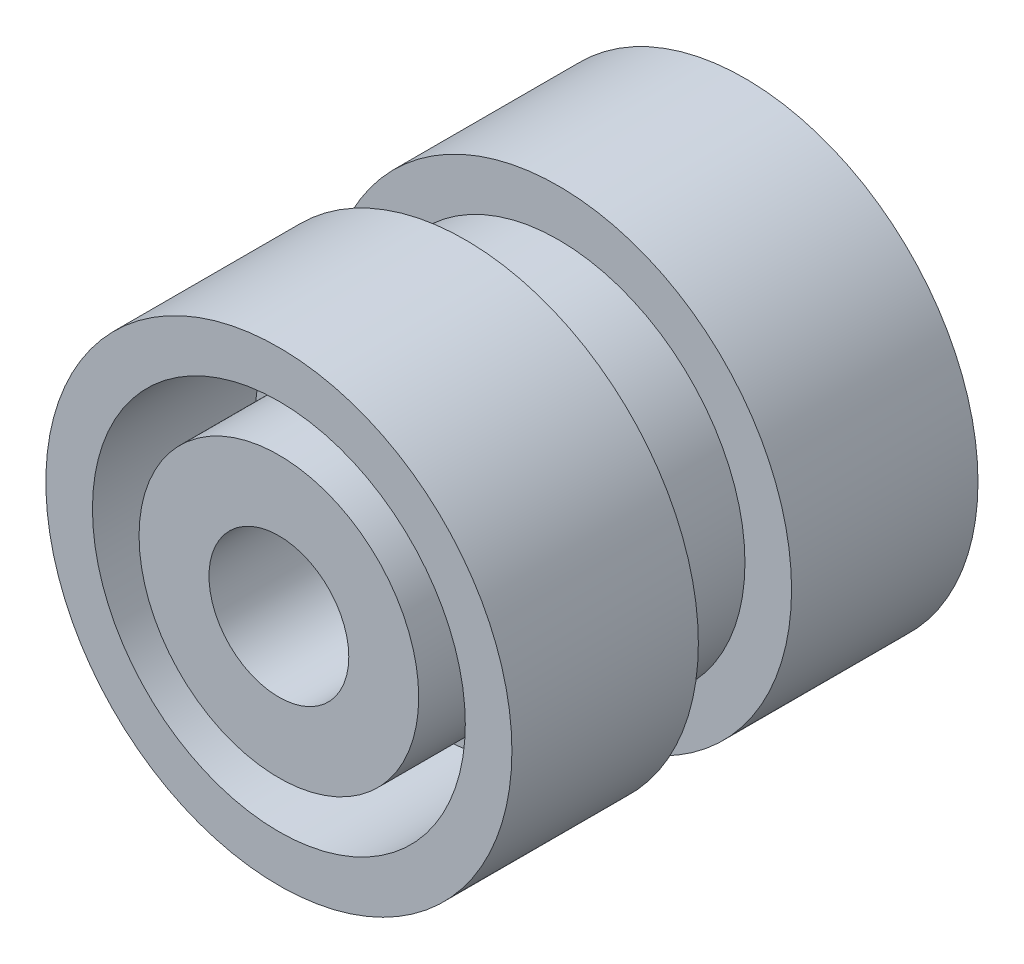
ISO-10303-21;
HEADER;
FILE_DESCRIPTION(('STEP AP214'),'2;1');
FILE_NAME('part.step','',(''),(''),'','','');
FILE_SCHEMA(('AUTOMOTIVE_DESIGN { 1 0 10303 214 1 1 1 1 }'));
ENDSEC;
DATA;
#1=APPLICATION_CONTEXT('core data for automotive mechanical design processes');
#2=APPLICATION_PROTOCOL_DEFINITION('international standard','automotive_design',2000,#1);
#3=PRODUCT_CONTEXT('',#1,'mechanical');
#4=PRODUCT('Part','Part','',(#3));
#5=PRODUCT_RELATED_PRODUCT_CATEGORY('part','',(#4));
#6=PRODUCT_DEFINITION_FORMATION('','',#4);
#7=PRODUCT_DEFINITION_CONTEXT('part definition',#1,'design');
#8=PRODUCT_DEFINITION('design','',#6,#7);
#9=PRODUCT_DEFINITION_SHAPE('','',#8);
#10=(LENGTH_UNIT() NAMED_UNIT(*) SI_UNIT(.MILLI.,.METRE.));
#11=(NAMED_UNIT(*) PLANE_ANGLE_UNIT() SI_UNIT($,.RADIAN.));
#12=(NAMED_UNIT(*) SI_UNIT($,.STERADIAN.) SOLID_ANGLE_UNIT());
#13=UNCERTAINTY_MEASURE_WITH_UNIT(LENGTH_MEASURE(1.E-05),#10,'distance_accuracy_value','');
#14=(GEOMETRIC_REPRESENTATION_CONTEXT(3) GLOBAL_UNCERTAINTY_ASSIGNED_CONTEXT((#13)) GLOBAL_UNIT_ASSIGNED_CONTEXT((#10,
#11,#12)) REPRESENTATION_CONTEXT('',''));
#15=CARTESIAN_POINT('',(0.,0.,0.));
#16=DIRECTION('',(0.,0.,1.));
#17=DIRECTION('',(1.,0.,0.));
#18=AXIS2_PLACEMENT_3D('',#15,#16,#17);
#19=CARTESIAN_POINT('',(0.,0.,-1.5));
#20=DIRECTION('',(0.,0.,1.));
#21=DIRECTION('',(1.,0.,0.));
#22=AXIS2_PLACEMENT_3D('',#19,#20,#21);
#23=PLANE('',#22);
#24=DIRECTION('',(1.,0.,0.));
#25=VECTOR('',#24,1.);
#26=CARTESIAN_POINT('',(-3.96862696659689,0.499999999999986,-1.5));
#27=LINE('',#26,#25);
#28=CARTESIAN_POINT('',(-3.96862696659689,0.499999999999986,-1.5));
#29=VERTEX_POINT('',#28);
#30=CARTESIAN_POINT('',(-1.93649167310371,0.499999999999993,-1.5));
#31=VERTEX_POINT('',#30);
#32=EDGE_CURVE('E186',#29,#31,#27,.T.);
#33=ORIENTED_EDGE('',*,*,#32,.F.);
#34=CARTESIAN_POINT('',(0.,0.,-1.5));
#35=DIRECTION('',(0.,0.,1.));
#36=DIRECTION('',(1.,0.,0.));
#37=AXIS2_PLACEMENT_3D('',#34,#35,#36);
#38=CIRCLE('',#37,4.);
#39=CARTESIAN_POINT('',(-0.5,3.96862696659689,-1.5));
#40=VERTEX_POINT('',#39);
#41=EDGE_CURVE('E40',#40,#29,#38,.T.);
#42=ORIENTED_EDGE('',*,*,#41,.F.);
#43=DIRECTION('',(0.,1.,0.));
#44=VECTOR('',#43,1.);
#45=CARTESIAN_POINT('',(-0.5,3.96862696659689,-1.5));
#46=LINE('',#45,#44);
#47=CARTESIAN_POINT('',(-0.5,1.93649167310371,-1.5));
#48=VERTEX_POINT('',#47);
#49=EDGE_CURVE('E190',#48,#40,#46,.T.);
#50=ORIENTED_EDGE('',*,*,#49,.F.);
#51=CARTESIAN_POINT('',(0.,0.,-1.5));
#52=DIRECTION('',(0.,0.,-1.));
#53=DIRECTION('',(-1.,0.,0.));
#54=AXIS2_PLACEMENT_3D('',#51,#52,#53);
#55=CIRCLE('',#54,2.);
#56=EDGE_CURVE('E188',#31,#48,#55,.T.);
#57=ORIENTED_EDGE('',*,*,#56,.F.);
#58=EDGE_LOOP('',(#33,#42,#50,#57));
#59=FACE_BOUND('',#58,.T.);
#60=ADVANCED_FACE('F32',(#59),#23,.F.);
#61=DIRECTION('',(0.,-1.,0.));
#62=VECTOR('',#61,1.);
#63=CARTESIAN_POINT('',(0.5,3.96862696659689,-1.5));
#64=LINE('',#63,#62);
#65=CARTESIAN_POINT('',(0.5,3.96862696659689,-1.5));
#66=VERTEX_POINT('',#65);
#67=CARTESIAN_POINT('',(0.5,1.93649167310371,-1.5));
#68=VERTEX_POINT('',#67);
#69=EDGE_CURVE('E192',#66,#68,#64,.T.);
#70=ORIENTED_EDGE('',*,*,#69,.F.);
#71=CARTESIAN_POINT('',(3.96862696659688,0.50000000000002,-1.5));
#72=VERTEX_POINT('',#71);
#73=EDGE_CURVE('E11',#72,#66,#38,.T.);
#74=ORIENTED_EDGE('',*,*,#73,.F.);
#75=DIRECTION('',(1.,0.,0.));
#76=VECTOR('',#75,1.);
#77=CARTESIAN_POINT('',(3.96862696659688,0.500000000000021,-1.5));
#78=LINE('',#77,#76);
#79=CARTESIAN_POINT('',(1.9364916731037,0.50000000000002,-1.5));
#80=VERTEX_POINT('',#79);
#81=EDGE_CURVE('E196',#80,#72,#78,.T.);
#82=ORIENTED_EDGE('',*,*,#81,.F.);
#83=CARTESIAN_POINT('',(0.,0.,-1.5));
#84=DIRECTION('',(0.,0.,-1.));
#85=DIRECTION('',(-1.,0.,0.));
#86=AXIS2_PLACEMENT_3D('',#83,#84,#85);
#87=CIRCLE('',#86,2.);
#88=EDGE_CURVE('E194',#68,#80,#87,.T.);
#89=ORIENTED_EDGE('',*,*,#88,.F.);
#90=EDGE_LOOP('',(#70,#74,#82,#89));
#91=FACE_BOUND('',#90,.T.);
#92=ADVANCED_FACE('F326',(#91),#23,.F.);
#93=DIRECTION('',(-1.,0.,0.));
#94=VECTOR('',#93,1.);
#95=CARTESIAN_POINT('',(3.96862696659689,-0.499999999999958,-1.5));
#96=LINE('',#95,#94);
#97=CARTESIAN_POINT('',(3.96862696659689,-0.499999999999958,-1.5));
#98=VERTEX_POINT('',#97);
#99=CARTESIAN_POINT('',(1.93649167310371,-0.49999999999998,-1.5));
#100=VERTEX_POINT('',#99);
#101=EDGE_CURVE('E198',#98,#100,#96,.T.);
#102=ORIENTED_EDGE('',*,*,#101,.F.);
#103=CARTESIAN_POINT('',(0.500000000000029,-3.96862696659688,-1.5));
#104=VERTEX_POINT('',#103);
#105=EDGE_CURVE('E41',#104,#98,#38,.T.);
#106=ORIENTED_EDGE('',*,*,#105,.F.);
#107=DIRECTION('',(0.,-1.,0.));
#108=VECTOR('',#107,1.);
#109=CARTESIAN_POINT('',(0.500000000000028,-3.96862696659688,-1.5));
#110=LINE('',#109,#108);
#111=CARTESIAN_POINT('',(0.500000000000014,-1.9364916731037,-1.5));
#112=VERTEX_POINT('',#111);
#113=EDGE_CURVE('E165',#112,#104,#110,.T.);
#114=ORIENTED_EDGE('',*,*,#113,.F.);
#115=CARTESIAN_POINT('',(0.,0.,-1.5));
#116=DIRECTION('',(0.,0.,-1.));
#117=DIRECTION('',(-1.,0.,0.));
#118=AXIS2_PLACEMENT_3D('',#115,#116,#117);
#119=CIRCLE('',#118,2.);
#120=EDGE_CURVE('E200',#100,#112,#119,.T.);
#121=ORIENTED_EDGE('',*,*,#120,.F.);
#122=EDGE_LOOP('',(#102,#106,#114,#121));
#123=FACE_BOUND('',#122,.T.);
#124=ADVANCED_FACE('F323',(#123),#23,.F.);
#125=DIRECTION('',(-1.,0.,0.));
#126=VECTOR('',#125,1.);
#127=CARTESIAN_POINT('',(-3.96862696659688,-0.500000000000014,-1.5));
#128=LINE('',#127,#126);
#129=CARTESIAN_POINT('',(-1.93649167310371,-0.500000000000007,-1.5));
#130=VERTEX_POINT('',#129);
#131=CARTESIAN_POINT('',(-3.96862696659688,-0.500000000000015,-1.5));
#132=VERTEX_POINT('',#131);
#133=EDGE_CURVE('E183',#130,#132,#128,.T.);
#134=ORIENTED_EDGE('',*,*,#133,.F.);
#135=CARTESIAN_POINT('',(0.,0.,-1.5));
#136=DIRECTION('',(0.,0.,-1.));
#137=DIRECTION('',(-1.,0.,0.));
#138=AXIS2_PLACEMENT_3D('',#135,#136,#137);
#139=CIRCLE('',#138,2.);
#140=CARTESIAN_POINT('',(-0.499999999999986,-1.93649167310371,-1.5));
#141=VERTEX_POINT('',#140);
#142=EDGE_CURVE('E180',#141,#130,#139,.T.);
#143=ORIENTED_EDGE('',*,*,#142,.F.);
#144=DIRECTION('',(0.,1.,0.));
#145=VECTOR('',#144,1.);
#146=CARTESIAN_POINT('',(-0.499999999999972,-3.96862696659689,-1.5));
#147=LINE('',#146,#145);
#148=CARTESIAN_POINT('',(-0.499999999999972,-3.96862696659689,-1.5));
#149=VERTEX_POINT('',#148);
#150=EDGE_CURVE('E111',#149,#141,#147,.T.);
#151=ORIENTED_EDGE('',*,*,#150,.F.);
#152=EDGE_CURVE('E271',#132,#149,#38,.T.);
#153=ORIENTED_EDGE('',*,*,#152,.F.);
#154=EDGE_LOOP('',(#134,#143,#151,#153));
#155=FACE_BOUND('',#154,.T.);
#156=ADVANCED_FACE('F325',(#155),#23,.F.);
#157=CARTESIAN_POINT('',(0.,0.,8.43540107464968));
#158=DIRECTION('',(0.,0.,1.));
#159=DIRECTION('',(1.,0.,0.));
#160=AXIS2_PLACEMENT_3D('',#157,#158,#159);
#161=CYLINDRICAL_SURFACE('',#160,4.);
#162=CARTESIAN_POINT('',(0.,0.,-5.));
#163=DIRECTION('',(0.,0.,1.));
#164=DIRECTION('',(1.,0.,0.));
#165=AXIS2_PLACEMENT_3D('',#162,#163,#164);
#166=CIRCLE('',#165,4.);
#167=CARTESIAN_POINT('',(4.,0.,-5.));
#168=VERTEX_POINT('',#167);
#169=EDGE_CURVE('E267',#168,#168,#166,.T.);
#170=ORIENTED_EDGE('',*,*,#169,.F.);
#171=EDGE_LOOP('',(#170));
#172=FACE_BOUND('',#171,.T.);
#173=DIRECTION('',(0.,0.,1.));
#174=VECTOR('',#173,1.);
#175=CARTESIAN_POINT('',(0.500000000000029,-3.96862696659688,-3.5));
#176=LINE('',#175,#174);
#177=CARTESIAN_POINT('',(0.500000000000029,-3.96862696659688,-3.5));
#178=VERTEX_POINT('',#177);
#179=EDGE_CURVE('E162',#178,#104,#176,.T.);
#180=ORIENTED_EDGE('',*,*,#179,.T.);
#181=ORIENTED_EDGE('',*,*,#105,.T.);
#182=DIRECTION('',(0.,0.,1.));
#183=VECTOR('',#182,1.);
#184=CARTESIAN_POINT('',(3.96862696659689,-0.499999999999958,-3.5));
#185=LINE('',#184,#183);
#186=CARTESIAN_POINT('',(3.96862696659689,-0.499999999999958,-3.5));
#187=VERTEX_POINT('',#186);
#188=EDGE_CURVE('E211',#187,#98,#185,.T.);
#189=ORIENTED_EDGE('',*,*,#188,.F.);
#190=CARTESIAN_POINT('',(0.,0.,-3.5));
#191=DIRECTION('',(0.,0.,-1.));
#192=DIRECTION('',(-1.,0.,0.));
#193=AXIS2_PLACEMENT_3D('',#190,#191,#192);
#194=CIRCLE('',#193,4.);
#195=CARTESIAN_POINT('',(3.96862696659688,0.50000000000002,-3.5));
#196=VERTEX_POINT('',#195);
#197=EDGE_CURVE('E310',#196,#187,#194,.T.);
#198=ORIENTED_EDGE('',*,*,#197,.F.);
#199=DIRECTION('',(0.,0.,1.));
#200=VECTOR('',#199,1.);
#201=CARTESIAN_POINT('',(3.96862696659688,0.50000000000002,-3.5));
#202=LINE('',#201,#200);
#203=EDGE_CURVE('E213',#196,#72,#202,.T.);
#204=ORIENTED_EDGE('',*,*,#203,.T.);
#205=ORIENTED_EDGE('',*,*,#73,.T.);
#206=DIRECTION('',(0.,0.,1.));
#207=VECTOR('',#206,1.);
#208=CARTESIAN_POINT('',(0.5,3.96862696659689,-3.5));
#209=LINE('',#208,#207);
#210=CARTESIAN_POINT('',(0.5,3.96862696659689,-3.5));
#211=VERTEX_POINT('',#210);
#212=EDGE_CURVE('E222',#211,#66,#209,.T.);
#213=ORIENTED_EDGE('',*,*,#212,.F.);
#214=CARTESIAN_POINT('',(0.,0.,-3.5));
#215=DIRECTION('',(0.,0.,-1.));
#216=DIRECTION('',(-1.,0.,0.));
#217=AXIS2_PLACEMENT_3D('',#214,#215,#216);
#218=CIRCLE('',#217,4.);
#219=CARTESIAN_POINT('',(-0.5,3.96862696659689,-3.5));
#220=VERTEX_POINT('',#219);
#221=EDGE_CURVE('E297',#220,#211,#218,.T.);
#222=ORIENTED_EDGE('',*,*,#221,.F.);
#223=DIRECTION('',(0.,0.,1.));
#224=VECTOR('',#223,1.);
#225=CARTESIAN_POINT('',(-0.5,3.96862696659689,-3.5));
#226=LINE('',#225,#224);
#227=EDGE_CURVE('E224',#220,#40,#226,.T.);
#228=ORIENTED_EDGE('',*,*,#227,.T.);
#229=ORIENTED_EDGE('',*,*,#41,.T.);
#230=DIRECTION('',(0.,0.,1.));
#231=VECTOR('',#230,1.);
#232=CARTESIAN_POINT('',(-3.96862696659689,0.499999999999986,-3.5));
#233=LINE('',#232,#231);
#234=CARTESIAN_POINT('',(-3.96862696659689,0.499999999999986,-3.5));
#235=VERTEX_POINT('',#234);
#236=EDGE_CURVE('E233',#235,#29,#233,.T.);
#237=ORIENTED_EDGE('',*,*,#236,.F.);
#238=CARTESIAN_POINT('',(0.,0.,-3.5));
#239=DIRECTION('',(0.,0.,-1.));
#240=DIRECTION('',(-1.,0.,0.));
#241=AXIS2_PLACEMENT_3D('',#238,#239,#240);
#242=CIRCLE('',#241,4.);
#243=CARTESIAN_POINT('',(-3.96862696659688,-0.500000000000014,-3.5));
#244=VERTEX_POINT('',#243);
#245=EDGE_CURVE('E299',#244,#235,#242,.T.);
#246=ORIENTED_EDGE('',*,*,#245,.F.);
#247=DIRECTION('',(0.,0.,1.));
#248=VECTOR('',#247,1.);
#249=CARTESIAN_POINT('',(-3.96862696659688,-0.500000000000015,-3.5));
#250=LINE('',#249,#248);
#251=EDGE_CURVE('E48',#244,#132,#250,.T.);
#252=ORIENTED_EDGE('',*,*,#251,.T.);
#253=ORIENTED_EDGE('',*,*,#152,.T.);
#254=DIRECTION('',(0.,0.,1.));
#255=VECTOR('',#254,1.);
#256=CARTESIAN_POINT('',(-0.499999999999972,-3.96862696659689,-3.5));
#257=LINE('',#256,#255);
#258=CARTESIAN_POINT('',(-0.499999999999972,-3.96862696659689,-3.5));
#259=VERTEX_POINT('',#258);
#260=EDGE_CURVE('E170',#259,#149,#257,.T.);
#261=ORIENTED_EDGE('',*,*,#260,.F.);
#262=CARTESIAN_POINT('',(0.,0.,-3.5));
#263=DIRECTION('',(0.,0.,-1.));
#264=DIRECTION('',(-1.,0.,0.));
#265=AXIS2_PLACEMENT_3D('',#262,#263,#264);
#266=CIRCLE('',#265,4.);
#267=EDGE_CURVE('E154',#178,#259,#266,.T.);
#268=ORIENTED_EDGE('',*,*,#267,.F.);
#269=EDGE_LOOP('',(#180,#181,#189,#198,#204,#205,#213,#222,#228,#229,#237,#246,#252,#253,#261,#268));
#270=FACE_BOUND('',#269,.T.);
#271=ADVANCED_FACE('F173',(#172,#270),#161,.F.);
#272=CARTESIAN_POINT('',(0.,3.,5.));
#273=DIRECTION('',(0.,0.,-1.));
#274=DIRECTION('',(-1.,0.,0.));
#275=AXIS2_PLACEMENT_3D('',#272,#273,#274);
#276=PLANE('',#275);
#277=CARTESIAN_POINT('',(0.,0.,5.));
#278=DIRECTION('',(0.,0.,1.));
#279=DIRECTION('',(1.,0.,0.));
#280=AXIS2_PLACEMENT_3D('',#277,#278,#279);
#281=CIRCLE('',#280,1.5);
#282=CARTESIAN_POINT('',(1.5,0.,5.));
#283=VERTEX_POINT('',#282);
#284=EDGE_CURVE('E629',#283,#283,#281,.T.);
#285=ORIENTED_EDGE('',*,*,#284,.F.);
#286=EDGE_LOOP('',(#285));
#287=FACE_BOUND('',#286,.T.);
#288=CARTESIAN_POINT('',(0.,0.,5.));
#289=DIRECTION('',(0.,0.,1.));
#290=DIRECTION('',(1.,0.,0.));
#291=AXIS2_PLACEMENT_3D('',#288,#289,#290);
#292=CIRCLE('',#291,3.);
#293=CARTESIAN_POINT('',(3.,0.,5.));
#294=VERTEX_POINT('',#293);
#295=EDGE_CURVE('E238',#294,#294,#292,.T.);
#296=ORIENTED_EDGE('',*,*,#295,.T.);
#297=EDGE_LOOP('',(#296));
#298=FACE_BOUND('',#297,.T.);
#299=ADVANCED_FACE('F34',(#287,#298),#276,.F.);
#300=CARTESIAN_POINT('',(0.,4.,-5.));
#301=DIRECTION('',(0.,0.,1.));
#302=DIRECTION('',(1.,0.,0.));
#303=AXIS2_PLACEMENT_3D('',#300,#301,#302);
#304=PLANE('',#303);
#305=CARTESIAN_POINT('',(0.,0.,-5.));
#306=DIRECTION('',(0.,0.,1.));
#307=DIRECTION('',(1.,0.,0.));
#308=AXIS2_PLACEMENT_3D('',#305,#306,#307);
#309=CIRCLE('',#308,5.);
#310=CARTESIAN_POINT('',(5.,0.,-5.));
#311=VERTEX_POINT('',#310);
#312=EDGE_CURVE('E265',#311,#311,#309,.T.);
#313=ORIENTED_EDGE('',*,*,#312,.F.);
#314=EDGE_LOOP('',(#313));
#315=FACE_BOUND('',#314,.T.);
#316=ORIENTED_EDGE('',*,*,#169,.T.);
#317=EDGE_LOOP('',(#316));
#318=FACE_BOUND('',#317,.T.);
#319=ADVANCED_FACE('F491',(#315,#318),#304,.F.);
#320=CARTESIAN_POINT('',(0.,0.,8.43540107464968));
#321=DIRECTION('',(0.,0.,1.));
#322=DIRECTION('',(1.,0.,0.));
#323=AXIS2_PLACEMENT_3D('',#320,#321,#322);
#324=CYLINDRICAL_SURFACE('',#323,5.);
#325=CARTESIAN_POINT('',(0.,0.,-0.999999999999999));
#326=DIRECTION('',(0.,0.,1.));
#327=DIRECTION('',(1.,0.,0.));
#328=AXIS2_PLACEMENT_3D('',#325,#326,#327);
#329=CIRCLE('',#328,5.);
#330=CARTESIAN_POINT('',(5.,0.,-0.999999999999999));
#331=VERTEX_POINT('',#330);
#332=EDGE_CURVE('E262',#331,#331,#329,.T.);
#333=ORIENTED_EDGE('',*,*,#332,.F.);
#334=EDGE_LOOP('',(#333));
#335=FACE_BOUND('',#334,.T.);
#336=ORIENTED_EDGE('',*,*,#312,.T.);
#337=EDGE_LOOP('',(#336));
#338=FACE_BOUND('',#337,.T.);
#339=ADVANCED_FACE('F545',(#335,#338),#324,.T.);
#340=CARTESIAN_POINT('',(0.,5.,-0.999999999999999));
#341=DIRECTION('',(0.,0.,-1.));
#342=DIRECTION('',(-1.,0.,0.));
#343=AXIS2_PLACEMENT_3D('',#340,#341,#342);
#344=PLANE('',#343);
#345=CARTESIAN_POINT('',(0.,0.,-0.999999999999999));
#346=DIRECTION('',(0.,0.,1.));
#347=DIRECTION('',(1.,0.,0.));
#348=AXIS2_PLACEMENT_3D('',#345,#346,#347);
#349=CIRCLE('',#348,4.);
#350=CARTESIAN_POINT('',(4.,0.,-0.999999999999999));
#351=VERTEX_POINT('',#350);
#352=EDGE_CURVE('E259',#351,#351,#349,.T.);
#353=ORIENTED_EDGE('',*,*,#352,.F.);
#354=EDGE_LOOP('',(#353));
#355=FACE_BOUND('',#354,.T.);
#356=ORIENTED_EDGE('',*,*,#332,.T.);
#357=EDGE_LOOP('',(#356));
#358=FACE_BOUND('',#357,.T.);
#359=ADVANCED_FACE('F541',(#355,#358),#344,.F.);
#360=CARTESIAN_POINT('',(0.,0.,8.43540107464968));
#361=DIRECTION('',(0.,0.,1.));
#362=DIRECTION('',(1.,0.,0.));
#363=AXIS2_PLACEMENT_3D('',#360,#361,#362);
#364=CYLINDRICAL_SURFACE('',#363,4.);
#365=CARTESIAN_POINT('',(0.,0.,1.));
#366=DIRECTION('',(0.,0.,1.));
#367=DIRECTION('',(1.,0.,0.));
#368=AXIS2_PLACEMENT_3D('',#365,#366,#367);
#369=CIRCLE('',#368,4.);
#370=CARTESIAN_POINT('',(4.,0.,1.));
#371=VERTEX_POINT('',#370);
#372=EDGE_CURVE('E256',#371,#371,#369,.T.);
#373=ORIENTED_EDGE('',*,*,#372,.F.);
#374=EDGE_LOOP('',(#373));
#375=FACE_BOUND('',#374,.T.);
#376=ORIENTED_EDGE('',*,*,#352,.T.);
#377=EDGE_LOOP('',(#376));
#378=FACE_BOUND('',#377,.T.);
#379=ADVANCED_FACE('F537',(#375,#378),#364,.T.);
#380=CARTESIAN_POINT('',(0.,4.,1.));
#381=DIRECTION('',(0.,0.,1.));
#382=DIRECTION('',(1.,0.,0.));
#383=AXIS2_PLACEMENT_3D('',#380,#381,#382);
#384=PLANE('',#383);
#385=CARTESIAN_POINT('',(0.,0.,1.));
#386=DIRECTION('',(0.,0.,1.));
#387=DIRECTION('',(1.,0.,0.));
#388=AXIS2_PLACEMENT_3D('',#385,#386,#387);
#389=CIRCLE('',#388,5.);
#390=CARTESIAN_POINT('',(5.,0.,1.));
#391=VERTEX_POINT('',#390);
#392=EDGE_CURVE('E253',#391,#391,#389,.T.);
#393=ORIENTED_EDGE('',*,*,#392,.F.);
#394=EDGE_LOOP('',(#393));
#395=FACE_BOUND('',#394,.T.);
#396=ORIENTED_EDGE('',*,*,#372,.T.);
#397=EDGE_LOOP('',(#396));
#398=FACE_BOUND('',#397,.T.);
#399=ADVANCED_FACE('F533',(#395,#398),#384,.F.);
#400=CARTESIAN_POINT('',(0.,0.,8.43540107464968));
#401=DIRECTION('',(0.,0.,1.));
#402=DIRECTION('',(1.,0.,0.));
#403=AXIS2_PLACEMENT_3D('',#400,#401,#402);
#404=CYLINDRICAL_SURFACE('',#403,5.);
#405=CARTESIAN_POINT('',(0.,0.,5.));
#406=DIRECTION('',(0.,0.,1.));
#407=DIRECTION('',(1.,0.,0.));
#408=AXIS2_PLACEMENT_3D('',#405,#406,#407);
#409=CIRCLE('',#408,5.);
#410=CARTESIAN_POINT('',(5.,0.,5.));
#411=VERTEX_POINT('',#410);
#412=EDGE_CURVE('E250',#411,#411,#409,.T.);
#413=ORIENTED_EDGE('',*,*,#412,.F.);
#414=EDGE_LOOP('',(#413));
#415=FACE_BOUND('',#414,.T.);
#416=ORIENTED_EDGE('',*,*,#392,.T.);
#417=EDGE_LOOP('',(#416));
#418=FACE_BOUND('',#417,.T.);
#419=ADVANCED_FACE('F529',(#415,#418),#404,.T.);
#420=CARTESIAN_POINT('',(0.,5.,5.));
#421=DIRECTION('',(0.,0.,-1.));
#422=DIRECTION('',(-1.,0.,0.));
#423=AXIS2_PLACEMENT_3D('',#420,#421,#422);
#424=PLANE('',#423);
#425=CARTESIAN_POINT('',(0.,0.,5.));
#426=DIRECTION('',(0.,0.,1.));
#427=DIRECTION('',(1.,0.,0.));
#428=AXIS2_PLACEMENT_3D('',#425,#426,#427);
#429=CIRCLE('',#428,4.);
#430=CARTESIAN_POINT('',(4.,0.,5.));
#431=VERTEX_POINT('',#430);
#432=EDGE_CURVE('E247',#431,#431,#429,.T.);
#433=ORIENTED_EDGE('',*,*,#432,.F.);
#434=EDGE_LOOP('',(#433));
#435=FACE_BOUND('',#434,.T.);
#436=ORIENTED_EDGE('',*,*,#412,.T.);
#437=EDGE_LOOP('',(#436));
#438=FACE_BOUND('',#437,.T.);
#439=ADVANCED_FACE('F525',(#435,#438),#424,.F.);
#440=CARTESIAN_POINT('',(0.,0.,8.43540107464968));
#441=DIRECTION('',(0.,0.,1.));
#442=DIRECTION('',(1.,0.,0.));
#443=AXIS2_PLACEMENT_3D('',#440,#441,#442);
#444=CYLINDRICAL_SURFACE('',#443,4.);
#445=CARTESIAN_POINT('',(0.,0.,1.5));
#446=DIRECTION('',(0.,0.,1.));
#447=DIRECTION('',(1.,0.,0.));
#448=AXIS2_PLACEMENT_3D('',#445,#446,#447);
#449=CIRCLE('',#448,4.);
#450=CARTESIAN_POINT('',(4.,0.,1.5));
#451=VERTEX_POINT('',#450);
#452=EDGE_CURVE('E244',#451,#451,#449,.T.);
#453=ORIENTED_EDGE('',*,*,#452,.F.);
#454=EDGE_LOOP('',(#453));
#455=FACE_BOUND('',#454,.T.);
#456=ORIENTED_EDGE('',*,*,#432,.T.);
#457=EDGE_LOOP('',(#456));
#458=FACE_BOUND('',#457,.T.);
#459=ADVANCED_FACE('F521',(#455,#458),#444,.F.);
#460=CARTESIAN_POINT('',(0.,4.,1.5));
#461=DIRECTION('',(0.,0.,-1.));
#462=DIRECTION('',(-1.,0.,0.));
#463=AXIS2_PLACEMENT_3D('',#460,#461,#462);
#464=PLANE('',#463);
#465=CARTESIAN_POINT('',(0.,0.,1.5));
#466=DIRECTION('',(0.,0.,1.));
#467=DIRECTION('',(1.,0.,0.));
#468=AXIS2_PLACEMENT_3D('',#465,#466,#467);
#469=CIRCLE('',#468,3.);
#470=CARTESIAN_POINT('',(3.,0.,1.5));
#471=VERTEX_POINT('',#470);
#472=EDGE_CURVE('E241',#471,#471,#469,.T.);
#473=ORIENTED_EDGE('',*,*,#472,.F.);
#474=EDGE_LOOP('',(#473));
#475=FACE_BOUND('',#474,.T.);
#476=ORIENTED_EDGE('',*,*,#452,.T.);
#477=EDGE_LOOP('',(#476));
#478=FACE_BOUND('',#477,.T.);
#479=ADVANCED_FACE('F517',(#475,#478),#464,.F.);
#480=CARTESIAN_POINT('',(0.,0.,8.43540107464968));
#481=DIRECTION('',(0.,0.,1.));
#482=DIRECTION('',(1.,0.,0.));
#483=AXIS2_PLACEMENT_3D('',#480,#481,#482);
#484=CYLINDRICAL_SURFACE('',#483,3.);
#485=ORIENTED_EDGE('',*,*,#295,.F.);
#486=EDGE_LOOP('',(#485));
#487=FACE_BOUND('',#486,.T.);
#488=ORIENTED_EDGE('',*,*,#472,.T.);
#489=EDGE_LOOP('',(#488));
#490=FACE_BOUND('',#489,.T.);
#491=ADVANCED_FACE('F373',(#487,#490),#484,.T.);
#492=CARTESIAN_POINT('',(0.,0.,-3.5));
#493=DIRECTION('',(0.,0.,1.));
#494=DIRECTION('',(1.,0.,0.));
#495=AXIS2_PLACEMENT_3D('',#492,#493,#494);
#496=CYLINDRICAL_SURFACE('',#495,2.);
#497=ORIENTED_EDGE('',*,*,#142,.T.);
#498=DIRECTION('',(0.,0.,1.));
#499=VECTOR('',#498,1.);
#500=CARTESIAN_POINT('',(-1.93649167310371,-0.500000000000007,-3.5));
#501=LINE('',#500,#499);
#502=CARTESIAN_POINT('',(-1.93649167310371,-0.500000000000007,-3.5));
#503=VERTEX_POINT('',#502);
#504=EDGE_CURVE('E236',#503,#130,#501,.T.);
#505=ORIENTED_EDGE('',*,*,#504,.F.);
#506=CARTESIAN_POINT('',(0.,0.,-3.5));
#507=DIRECTION('',(0.,0.,-1.));
#508=DIRECTION('',(-1.,0.,0.));
#509=AXIS2_PLACEMENT_3D('',#506,#507,#508);
#510=CIRCLE('',#509,2.);
#511=CARTESIAN_POINT('',(-0.499999999999986,-1.93649167310371,-3.5));
#512=VERTEX_POINT('',#511);
#513=EDGE_CURVE('E204',#512,#503,#510,.T.);
#514=ORIENTED_EDGE('',*,*,#513,.F.);
#515=DIRECTION('',(0.,0.,1.));
#516=VECTOR('',#515,1.);
#517=CARTESIAN_POINT('',(-0.499999999999986,-1.93649167310371,-3.5));
#518=LINE('',#517,#516);
#519=EDGE_CURVE('E176',#512,#141,#518,.T.);
#520=ORIENTED_EDGE('',*,*,#519,.T.);
#521=EDGE_LOOP('',(#497,#505,#514,#520));
#522=FACE_BOUND('',#521,.T.);
#523=ADVANCED_FACE('F367',(#522),#496,.T.);
#524=CARTESIAN_POINT('',(-3.96862696659688,-0.500000000000014,-3.5));
#525=DIRECTION('',(0.,1.,0.));
#526=DIRECTION('',(-1.,0.,0.));
#527=AXIS2_PLACEMENT_3D('',#524,#525,#526);
#528=PLANE('',#527);
#529=ORIENTED_EDGE('',*,*,#133,.T.);
#530=ORIENTED_EDGE('',*,*,#251,.F.);
#531=DIRECTION('',(-1.,0.,0.));
#532=VECTOR('',#531,1.);
#533=CARTESIAN_POINT('',(-3.96862696659688,-0.500000000000014,-3.5));
#534=LINE('',#533,#532);
#535=EDGE_CURVE('E115',#503,#244,#534,.T.);
#536=ORIENTED_EDGE('',*,*,#535,.F.);
#537=ORIENTED_EDGE('',*,*,#504,.T.);
#538=EDGE_LOOP('',(#529,#530,#536,#537));
#539=FACE_BOUND('',#538,.T.);
#540=ADVANCED_FACE('F372',(#539),#528,.F.);
#541=CARTESIAN_POINT('',(-3.96862696659689,0.499999999999986,-3.5));
#542=DIRECTION('',(0.,-1.,0.));
#543=DIRECTION('',(1.,0.,0.));
#544=AXIS2_PLACEMENT_3D('',#541,#542,#543);
#545=PLANE('',#544);
#546=ORIENTED_EDGE('',*,*,#32,.T.);
#547=DIRECTION('',(0.,0.,1.));
#548=VECTOR('',#547,1.);
#549=CARTESIAN_POINT('',(-1.93649167310371,0.499999999999993,-3.5));
#550=LINE('',#549,#548);
#551=CARTESIAN_POINT('',(-1.93649167310371,0.499999999999993,-3.5));
#552=VERTEX_POINT('',#551);
#553=EDGE_CURVE('E230',#552,#31,#550,.T.);
#554=ORIENTED_EDGE('',*,*,#553,.F.);
#555=DIRECTION('',(1.,0.,0.));
#556=VECTOR('',#555,1.);
#557=CARTESIAN_POINT('',(-3.96862696659689,0.499999999999986,-3.5));
#558=LINE('',#557,#556);
#559=EDGE_CURVE('E295',#235,#552,#558,.T.);
#560=ORIENTED_EDGE('',*,*,#559,.F.);
#561=ORIENTED_EDGE('',*,*,#236,.T.);
#562=EDGE_LOOP('',(#546,#554,#560,#561));
#563=FACE_BOUND('',#562,.T.);
#564=ADVANCED_FACE('F286',(#563),#545,.F.);
#565=CARTESIAN_POINT('',(0.,0.,-3.5));
#566=DIRECTION('',(0.,0.,1.));
#567=DIRECTION('',(1.,0.,0.));
#568=AXIS2_PLACEMENT_3D('',#565,#566,#567);
#569=CYLINDRICAL_SURFACE('',#568,2.);
#570=ORIENTED_EDGE('',*,*,#56,.T.);
#571=DIRECTION('',(0.,0.,1.));
#572=VECTOR('',#571,1.);
#573=CARTESIAN_POINT('',(-0.5,1.93649167310371,-3.5));
#574=LINE('',#573,#572);
#575=CARTESIAN_POINT('',(-0.5,1.93649167310371,-3.5));
#576=VERTEX_POINT('',#575);
#577=EDGE_CURVE('E227',#576,#48,#574,.T.);
#578=ORIENTED_EDGE('',*,*,#577,.F.);
#579=CARTESIAN_POINT('',(0.,0.,-3.5));
#580=DIRECTION('',(0.,0.,-1.));
#581=DIRECTION('',(-1.,0.,0.));
#582=AXIS2_PLACEMENT_3D('',#579,#580,#581);
#583=CIRCLE('',#582,2.);
#584=EDGE_CURVE('E292',#552,#576,#583,.T.);
#585=ORIENTED_EDGE('',*,*,#584,.F.);
#586=ORIENTED_EDGE('',*,*,#553,.T.);
#587=EDGE_LOOP('',(#570,#578,#585,#586));
#588=FACE_BOUND('',#587,.T.);
#589=ADVANCED_FACE('F290',(#588),#569,.T.);
#590=CARTESIAN_POINT('',(-0.5,3.96862696659689,-3.5));
#591=DIRECTION('',(1.,0.,0.));
#592=DIRECTION('',(0.,0.,-1.));
#593=AXIS2_PLACEMENT_3D('',#590,#591,#592);
#594=PLANE('',#593);
#595=ORIENTED_EDGE('',*,*,#49,.T.);
#596=ORIENTED_EDGE('',*,*,#227,.F.);
#597=DIRECTION('',(0.,1.,0.));
#598=VECTOR('',#597,1.);
#599=CARTESIAN_POINT('',(-0.5,3.96862696659689,-3.5));
#600=LINE('',#599,#598);
#601=EDGE_CURVE('E294',#576,#220,#600,.T.);
#602=ORIENTED_EDGE('',*,*,#601,.F.);
#603=ORIENTED_EDGE('',*,*,#577,.T.);
#604=EDGE_LOOP('',(#595,#596,#602,#603));
#605=FACE_BOUND('',#604,.T.);
#606=ADVANCED_FACE('F400',(#605),#594,.F.);
#607=CARTESIAN_POINT('',(0.5,3.96862696659689,-3.5));
#608=DIRECTION('',(-1.,0.,0.));
#609=DIRECTION('',(0.,0.,1.));
#610=AXIS2_PLACEMENT_3D('',#607,#608,#609);
#611=PLANE('',#610);
#612=ORIENTED_EDGE('',*,*,#69,.T.);
#613=DIRECTION('',(0.,0.,1.));
#614=VECTOR('',#613,1.);
#615=CARTESIAN_POINT('',(0.5,1.93649167310371,-3.5));
#616=LINE('',#615,#614);
#617=CARTESIAN_POINT('',(0.5,1.93649167310371,-3.5));
#618=VERTEX_POINT('',#617);
#619=EDGE_CURVE('E219',#618,#68,#616,.T.);
#620=ORIENTED_EDGE('',*,*,#619,.F.);
#621=DIRECTION('',(0.,-1.,0.));
#622=VECTOR('',#621,1.);
#623=CARTESIAN_POINT('',(0.5,3.96862696659689,-3.5));
#624=LINE('',#623,#622);
#625=EDGE_CURVE('E304',#211,#618,#624,.T.);
#626=ORIENTED_EDGE('',*,*,#625,.F.);
#627=ORIENTED_EDGE('',*,*,#212,.T.);
#628=EDGE_LOOP('',(#612,#620,#626,#627));
#629=FACE_BOUND('',#628,.T.);
#630=ADVANCED_FACE('F409',(#629),#611,.F.);
#631=CARTESIAN_POINT('',(0.,0.,-3.5));
#632=DIRECTION('',(0.,0.,1.));
#633=DIRECTION('',(1.,0.,0.));
#634=AXIS2_PLACEMENT_3D('',#631,#632,#633);
#635=CYLINDRICAL_SURFACE('',#634,2.);
#636=ORIENTED_EDGE('',*,*,#88,.T.);
#637=DIRECTION('',(0.,0.,1.));
#638=VECTOR('',#637,1.);
#639=CARTESIAN_POINT('',(1.9364916731037,0.50000000000002,-3.5));
#640=LINE('',#639,#638);
#641=CARTESIAN_POINT('',(1.9364916731037,0.50000000000002,-3.5));
#642=VERTEX_POINT('',#641);
#643=EDGE_CURVE('E216',#642,#80,#640,.T.);
#644=ORIENTED_EDGE('',*,*,#643,.F.);
#645=CARTESIAN_POINT('',(0.,0.,-3.5));
#646=DIRECTION('',(0.,0.,-1.));
#647=DIRECTION('',(-1.,0.,0.));
#648=AXIS2_PLACEMENT_3D('',#645,#646,#647);
#649=CIRCLE('',#648,2.);
#650=EDGE_CURVE('E306',#618,#642,#649,.T.);
#651=ORIENTED_EDGE('',*,*,#650,.F.);
#652=ORIENTED_EDGE('',*,*,#619,.T.);
#653=EDGE_LOOP('',(#636,#644,#651,#652));
#654=FACE_BOUND('',#653,.T.);
#655=ADVANCED_FACE('F419',(#654),#635,.T.);
#656=CARTESIAN_POINT('',(3.96862696659688,0.500000000000021,-3.5));
#657=DIRECTION('',(0.,-1.,0.));
#658=DIRECTION('',(1.,0.,0.));
#659=AXIS2_PLACEMENT_3D('',#656,#657,#658);
#660=PLANE('',#659);
#661=ORIENTED_EDGE('',*,*,#81,.T.);
#662=ORIENTED_EDGE('',*,*,#203,.F.);
#663=DIRECTION('',(1.,0.,0.));
#664=VECTOR('',#663,1.);
#665=CARTESIAN_POINT('',(3.96862696659688,0.500000000000021,-3.5));
#666=LINE('',#665,#664);
#667=EDGE_CURVE('E308',#642,#196,#666,.T.);
#668=ORIENTED_EDGE('',*,*,#667,.F.);
#669=ORIENTED_EDGE('',*,*,#643,.T.);
#670=EDGE_LOOP('',(#661,#662,#668,#669));
#671=FACE_BOUND('',#670,.T.);
#672=ADVANCED_FACE('F429',(#671),#660,.F.);
#673=CARTESIAN_POINT('',(3.96862696659689,-0.499999999999958,-3.5));
#674=DIRECTION('',(0.,1.,0.));
#675=DIRECTION('',(-1.,0.,0.));
#676=AXIS2_PLACEMENT_3D('',#673,#674,#675);
#677=PLANE('',#676);
#678=ORIENTED_EDGE('',*,*,#101,.T.);
#679=DIRECTION('',(0.,0.,1.));
#680=VECTOR('',#679,1.);
#681=CARTESIAN_POINT('',(1.93649167310371,-0.49999999999998,-3.5));
#682=LINE('',#681,#680);
#683=CARTESIAN_POINT('',(1.93649167310371,-0.49999999999998,-3.5));
#684=VERTEX_POINT('',#683);
#685=EDGE_CURVE('E208',#684,#100,#682,.T.);
#686=ORIENTED_EDGE('',*,*,#685,.F.);
#687=DIRECTION('',(-1.,0.,0.));
#688=VECTOR('',#687,1.);
#689=CARTESIAN_POINT('',(3.96862696659689,-0.499999999999958,-3.5));
#690=LINE('',#689,#688);
#691=EDGE_CURVE('E312',#187,#684,#690,.T.);
#692=ORIENTED_EDGE('',*,*,#691,.F.);
#693=ORIENTED_EDGE('',*,*,#188,.T.);
#694=EDGE_LOOP('',(#678,#686,#692,#693));
#695=FACE_BOUND('',#694,.T.);
#696=ADVANCED_FACE('F317',(#695),#677,.F.);
#697=CARTESIAN_POINT('',(0.,0.,-3.5));
#698=DIRECTION('',(0.,0.,1.));
#699=DIRECTION('',(1.,0.,0.));
#700=AXIS2_PLACEMENT_3D('',#697,#698,#699);
#701=CYLINDRICAL_SURFACE('',#700,2.);
#702=ORIENTED_EDGE('',*,*,#120,.T.);
#703=DIRECTION('',(0.,0.,1.));
#704=VECTOR('',#703,1.);
#705=CARTESIAN_POINT('',(0.500000000000014,-1.9364916731037,-3.5));
#706=LINE('',#705,#704);
#707=CARTESIAN_POINT('',(0.500000000000014,-1.9364916731037,-3.5));
#708=VERTEX_POINT('',#707);
#709=EDGE_CURVE('E169',#708,#112,#706,.T.);
#710=ORIENTED_EDGE('',*,*,#709,.F.);
#711=CARTESIAN_POINT('',(0.,0.,-3.5));
#712=DIRECTION('',(0.,0.,-1.));
#713=DIRECTION('',(-1.,0.,0.));
#714=AXIS2_PLACEMENT_3D('',#711,#712,#713);
#715=CIRCLE('',#714,2.);
#716=EDGE_CURVE('E156',#684,#708,#715,.T.);
#717=ORIENTED_EDGE('',*,*,#716,.F.);
#718=ORIENTED_EDGE('',*,*,#685,.T.);
#719=EDGE_LOOP('',(#702,#710,#717,#718));
#720=FACE_BOUND('',#719,.T.);
#721=ADVANCED_FACE('F321',(#720),#701,.T.);
#722=CARTESIAN_POINT('',(0.500000000000028,-3.96862696659688,-3.5));
#723=DIRECTION('',(-1.,0.,0.));
#724=DIRECTION('',(0.,-1.,0.));
#725=AXIS2_PLACEMENT_3D('',#722,#723,#724);
#726=PLANE('',#725);
#727=ORIENTED_EDGE('',*,*,#113,.T.);
#728=ORIENTED_EDGE('',*,*,#179,.F.);
#729=DIRECTION('',(0.,-1.,0.));
#730=VECTOR('',#729,1.);
#731=CARTESIAN_POINT('',(0.500000000000028,-3.96862696659688,-3.5));
#732=LINE('',#731,#730);
#733=EDGE_CURVE('E150',#708,#178,#732,.T.);
#734=ORIENTED_EDGE('',*,*,#733,.F.);
#735=ORIENTED_EDGE('',*,*,#709,.T.);
#736=EDGE_LOOP('',(#727,#728,#734,#735));
#737=FACE_BOUND('',#736,.T.);
#738=ADVANCED_FACE('F163',(#737),#726,.F.);
#739=CARTESIAN_POINT('',(-0.499999999999972,-3.96862696659689,-3.5));
#740=DIRECTION('',(1.,0.,0.));
#741=DIRECTION('',(0.,1.,0.));
#742=AXIS2_PLACEMENT_3D('',#739,#740,#741);
#743=PLANE('',#742);
#744=ORIENTED_EDGE('',*,*,#150,.T.);
#745=ORIENTED_EDGE('',*,*,#519,.F.);
#746=DIRECTION('',(0.,1.,0.));
#747=VECTOR('',#746,1.);
#748=CARTESIAN_POINT('',(-0.499999999999972,-3.96862696659689,-3.5));
#749=LINE('',#748,#747);
#750=EDGE_CURVE('E57',#259,#512,#749,.T.);
#751=ORIENTED_EDGE('',*,*,#750,.F.);
#752=ORIENTED_EDGE('',*,*,#260,.T.);
#753=EDGE_LOOP('',(#744,#745,#751,#752));
#754=FACE_BOUND('',#753,.T.);
#755=ADVANCED_FACE('F464',(#754),#743,.F.);
#756=CARTESIAN_POINT('',(0.,0.,-3.5));
#757=DIRECTION('',(0.,0.,-1.));
#758=DIRECTION('',(-1.,0.,0.));
#759=AXIS2_PLACEMENT_3D('',#756,#757,#758);
#760=PLANE('',#759);
#761=ORIENTED_EDGE('',*,*,#513,.T.);
#762=ORIENTED_EDGE('',*,*,#535,.T.);
#763=ORIENTED_EDGE('',*,*,#245,.T.);
#764=ORIENTED_EDGE('',*,*,#559,.T.);
#765=ORIENTED_EDGE('',*,*,#584,.T.);
#766=ORIENTED_EDGE('',*,*,#601,.T.);
#767=ORIENTED_EDGE('',*,*,#221,.T.);
#768=ORIENTED_EDGE('',*,*,#625,.T.);
#769=ORIENTED_EDGE('',*,*,#650,.T.);
#770=ORIENTED_EDGE('',*,*,#667,.T.);
#771=ORIENTED_EDGE('',*,*,#197,.T.);
#772=ORIENTED_EDGE('',*,*,#691,.T.);
#773=ORIENTED_EDGE('',*,*,#716,.T.);
#774=ORIENTED_EDGE('',*,*,#733,.T.);
#775=ORIENTED_EDGE('',*,*,#267,.T.);
#776=ORIENTED_EDGE('',*,*,#750,.T.);
#777=EDGE_LOOP('',(#761,#762,#763,#764,#765,#766,#767,#768,#769,#770,#771,#772,#773,#774,#775,#776));
#778=FACE_BOUND('',#777,.T.);
#779=ADVANCED_FACE('F152',(#778),#760,.T.);
#780=CARTESIAN_POINT('',(0.,0.,-3.));
#781=DIRECTION('',(0.,0.,1.));
#782=DIRECTION('',(1.,0.,0.));
#783=AXIS2_PLACEMENT_3D('',#780,#781,#782);
#784=CYLINDRICAL_SURFACE('',#783,1.5);
#785=CARTESIAN_POINT('',(0.,0.,-3.));
#786=DIRECTION('',(0.,0.,1.));
#787=DIRECTION('',(1.,0.,0.));
#788=AXIS2_PLACEMENT_3D('',#785,#786,#787);
#789=CIRCLE('',#788,1.5);
#790=CARTESIAN_POINT('',(1.5,0.,-3.));
#791=VERTEX_POINT('',#790);
#792=EDGE_CURVE('E184',#791,#791,#789,.T.);
#793=ORIENTED_EDGE('',*,*,#792,.F.);
#794=EDGE_LOOP('',(#793));
#795=FACE_BOUND('',#794,.T.);
#796=ORIENTED_EDGE('',*,*,#284,.T.);
#797=EDGE_LOOP('',(#796));
#798=FACE_BOUND('',#797,.T.);
#799=ADVANCED_FACE('F481',(#795,#798),#784,.F.);
#800=CARTESIAN_POINT('',(0.,0.,-3.));
#801=DIRECTION('',(0.,0.,1.));
#802=DIRECTION('',(1.,0.,0.));
#803=AXIS2_PLACEMENT_3D('',#800,#801,#802);
#804=PLANE('',#803);
#805=ORIENTED_EDGE('',*,*,#792,.T.);
#806=EDGE_LOOP('',(#805));
#807=FACE_BOUND('',#806,.T.);
#808=ADVANCED_FACE('F500',(#807),#804,.T.);
#809=CLOSED_SHELL('',(#60,#92,#124,#156,#271,#299,#319,#339,#359,#379,#399,#419,#439,#459,#479,
#491,#523,#540,#564,#589,#606,#630,#655,#672,#696,#721,#738,#755,#779,#799,#808));
#810=MANIFOLD_SOLID_BREP('B2',#809);
#811=ADVANCED_BREP_SHAPE_REPRESENTATION('',(#18,#810),#14);
#812=SHAPE_DEFINITION_REPRESENTATION(#9,#811);
ENDSEC;
END-ISO-10303-21;
